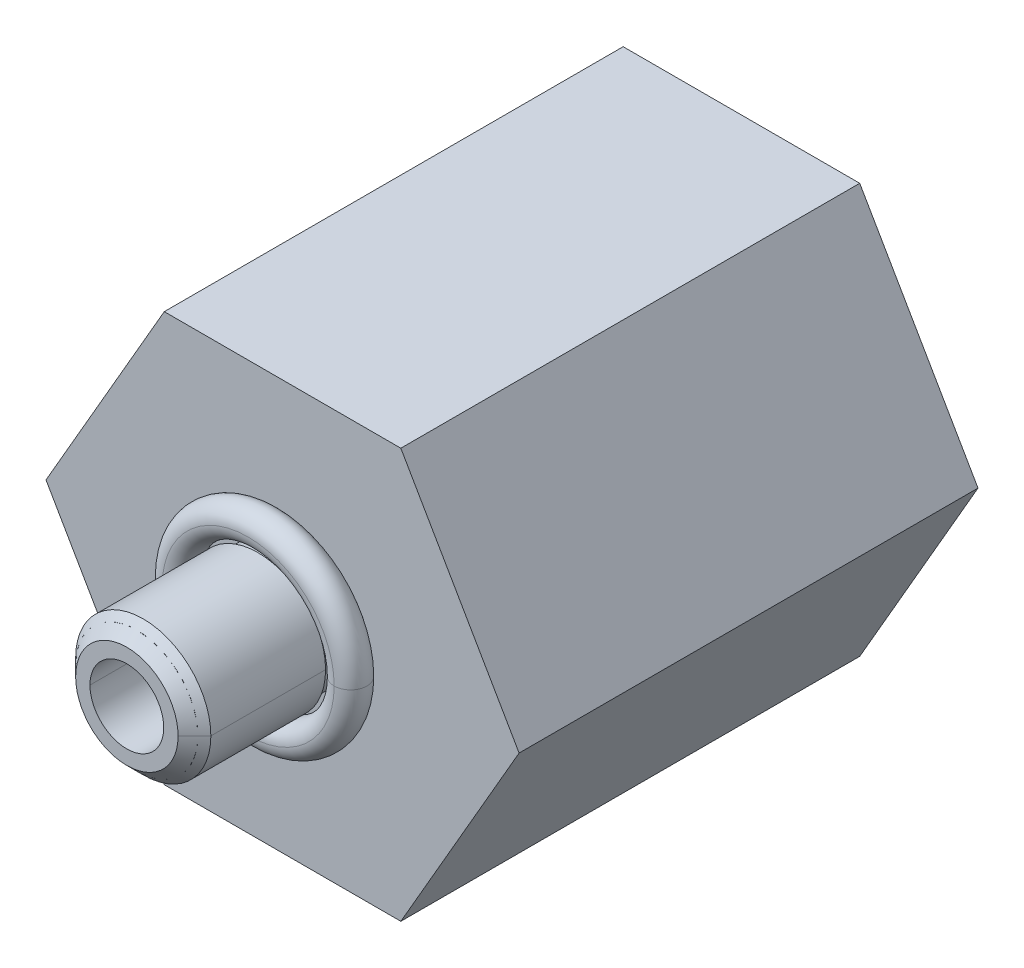
ISO-10303-21;
HEADER;
FILE_DESCRIPTION(('STEP AP214'),'2;1');
FILE_NAME('part.step','',(''),(''),'','','');
FILE_SCHEMA(('AUTOMOTIVE_DESIGN { 1 0 10303 214 1 1 1 1 }'));
ENDSEC;
DATA;
#1=APPLICATION_CONTEXT('core data for automotive mechanical design processes');
#2=APPLICATION_PROTOCOL_DEFINITION('international standard','automotive_design',2000,#1);
#3=PRODUCT_CONTEXT('',#1,'mechanical');
#4=PRODUCT('Part','Part','',(#3));
#5=PRODUCT_RELATED_PRODUCT_CATEGORY('part','',(#4));
#6=PRODUCT_DEFINITION_FORMATION('','',#4);
#7=PRODUCT_DEFINITION_CONTEXT('part definition',#1,'design');
#8=PRODUCT_DEFINITION('design','',#6,#7);
#9=PRODUCT_DEFINITION_SHAPE('','',#8);
#10=(LENGTH_UNIT() NAMED_UNIT(*) SI_UNIT(.MILLI.,.METRE.));
#11=(NAMED_UNIT(*) PLANE_ANGLE_UNIT() SI_UNIT($,.RADIAN.));
#12=(NAMED_UNIT(*) SI_UNIT($,.STERADIAN.) SOLID_ANGLE_UNIT());
#13=UNCERTAINTY_MEASURE_WITH_UNIT(LENGTH_MEASURE(1.E-05),#10,'distance_accuracy_value','');
#14=(GEOMETRIC_REPRESENTATION_CONTEXT(3) GLOBAL_UNCERTAINTY_ASSIGNED_CONTEXT((#13)) GLOBAL_UNIT_ASSIGNED_CONTEXT((#10,
#11,#12)) REPRESENTATION_CONTEXT('',''));
#15=CARTESIAN_POINT('',(0.,0.,0.));
#16=DIRECTION('',(0.,0.,1.));
#17=DIRECTION('',(1.,0.,0.));
#18=AXIS2_PLACEMENT_3D('',#15,#16,#17);
#19=CARTESIAN_POINT('',(0.,0.,3.937));
#20=DIRECTION('',(0.,0.,-1.));
#21=DIRECTION('',(1.,0.,0.));
#22=AXIS2_PLACEMENT_3D('',#19,#20,#21);
#23=CONICAL_SURFACE('',#22,5.3122622078521,0.0570722665402047);
#24=CARTESIAN_POINT('',(0.,0.,7.874));
#25=DIRECTION('',(0.,0.,-1.));
#26=DIRECTION('',(-1.,0.,0.));
#27=AXIS2_PLACEMENT_3D('',#24,#25,#26);
#28=CIRCLE('',#27,5.08732441570478);
#29=CARTESIAN_POINT('',(-5.08732441570478,0.,7.874));
#30=VERTEX_POINT('',#29);
#31=CARTESIAN_POINT('',(5.08732441570478,0.,7.874));
#32=VERTEX_POINT('',#31);
#33=EDGE_CURVE('P0_E26',#30,#32,#28,.T.);
#34=ORIENTED_EDGE('',*,*,#33,.T.);
#35=CARTESIAN_POINT('',(5.08732441570478,0.,7.874));
#36=DIRECTION('',(0.0570412885398825,0.,-0.998371820216151));
#37=VECTOR('',#36,1.);
#38=LINE('',#35,#37);
#39=CARTESIAN_POINT('',(5.53719999999961,0.,0.));
#40=VERTEX_POINT('',#39);
#41=EDGE_CURVE('P0_E10',#32,#40,#38,.T.);
#42=ORIENTED_EDGE('',*,*,#41,.T.);
#43=CARTESIAN_POINT('',(0.,0.,0.));
#44=DIRECTION('',(0.,0.,1.));
#45=DIRECTION('',(1.,0.,0.));
#46=AXIS2_PLACEMENT_3D('',#43,#44,#45);
#47=CIRCLE('',#46,5.53719999999942);
#48=CARTESIAN_POINT('',(-5.53719999999961,0.,0.));
#49=VERTEX_POINT('',#48);
#50=EDGE_CURVE('P0_E74',#40,#49,#47,.T.);
#51=ORIENTED_EDGE('',*,*,#50,.T.);
#52=CARTESIAN_POINT('',(-5.53719999999942,0.,0.));
#53=DIRECTION('',(0.0570412885398825,0.,0.998371820216151));
#54=VECTOR('',#53,1.);
#55=LINE('',#52,#54);
#56=EDGE_CURVE('P0_E119',#49,#30,#55,.T.);
#57=ORIENTED_EDGE('',*,*,#56,.T.);
#58=EDGE_LOOP('',(#34,#42,#51,#57));
#59=FACE_BOUND('',#58,.T.);
#60=ADVANCED_FACE('P0_F15',(#59),#23,.T.);
#61=CARTESIAN_POINT('',(0.,0.,3.937));
#62=DIRECTION('',(0.,0.,-1.));
#63=DIRECTION('',(1.,0.,0.));
#64=AXIS2_PLACEMENT_3D('',#61,#62,#63);
#65=CONICAL_SURFACE('',#64,5.3122622078521,0.0570722665402047);
#66=CARTESIAN_POINT('',(0.,0.,0.));
#67=DIRECTION('',(0.,0.,1.));
#68=DIRECTION('',(-1.,0.,0.));
#69=AXIS2_PLACEMENT_3D('',#66,#67,#68);
#70=CIRCLE('',#69,5.53719999999942);
#71=EDGE_CURVE('P0_E84',#49,#40,#70,.T.);
#72=ORIENTED_EDGE('',*,*,#71,.T.);
#73=ORIENTED_EDGE('',*,*,#41,.F.);
#74=CARTESIAN_POINT('',(0.,0.,7.874));
#75=DIRECTION('',(0.,0.,-1.));
#76=DIRECTION('',(1.,0.,0.));
#77=AXIS2_PLACEMENT_3D('',#74,#75,#76);
#78=CIRCLE('',#77,5.08732441570478);
#79=EDGE_CURVE('P0_E53',#32,#30,#78,.T.);
#80=ORIENTED_EDGE('',*,*,#79,.T.);
#81=ORIENTED_EDGE('',*,*,#56,.F.);
#82=EDGE_LOOP('',(#72,#73,#80,#81));
#83=FACE_BOUND('',#82,.T.);
#84=ADVANCED_FACE('P0_F89',(#83),#65,.T.);
#85=CARTESIAN_POINT('',(0.,0.,0.));
#86=DIRECTION('',(0.,0.,-1.));
#87=DIRECTION('',(0.,-1.,0.));
#88=AXIS2_PLACEMENT_3D('',#85,#86,#87);
#89=PLANE('',#88);
#90=CARTESIAN_POINT('',(-5.08,0.,0.));
#91=CARTESIAN_POINT('',(-5.08,-0.500058510185671,0.));
#92=CARTESIAN_POINT('',(-4.98238922444841,-0.991058835841932,0.));
#93=CARTESIAN_POINT('',(-4.88493882071838,-1.48125246145747,0.));
#94=CARTESIAN_POINT('',(-4.69330802515734,-1.94403183641466,0.));
#95=CARTESIAN_POINT('',(-4.50209807133947,-2.40579489831895,0.));
#96=CARTESIAN_POINT('',(-4.22386563049693,-2.82229678373958,0.));
#97=CARTESIAN_POINT('',(-3.94624421788446,-3.23788398642552,0.));
#98=CARTESIAN_POINT('',(-3.59210244842766,-3.59210244842766,0.));
#99=CARTESIAN_POINT('',(-3.23873841221395,-3.94554300876168,0.));
#100=CARTESIAN_POINT('',(-2.82229678373958,-4.22386563049693,0.));
#101=CARTESIAN_POINT('',(-2.40676970566655,-4.50157702595698,0.));
#102=CARTESIAN_POINT('',(-1.94403183641466,-4.69330802515734,0.));
#103=CARTESIAN_POINT('',(-1.48231018906274,-4.8846179625574,0.));
#104=CARTESIAN_POINT('',(-0.991058835841934,-4.98238922444841,0.));
#105=CARTESIAN_POINT('',(-0.500886323184134,-5.07994577018133,0.));
#106=CARTESIAN_POINT('',(0.,-5.08,0.));
#107=CARTESIAN_POINT('',(0.499786323195578,-5.08005411072419,0.));
#108=CARTESIAN_POINT('',(0.991058835841932,-4.98238922444841,0.));
#109=CARTESIAN_POINT('',(1.48125246145766,-4.88493882071834,0.));
#110=CARTESIAN_POINT('',(1.94403183641466,-4.69330802515734,0.));
#111=CARTESIAN_POINT('',(2.40579489832119,-4.5020980713385,0.));
#112=CARTESIAN_POINT('',(2.82229678373958,-4.22386563049693,0.));
#113=CARTESIAN_POINT('',(3.23788398642889,-3.94624421788168,0.));
#114=CARTESIAN_POINT('',(3.59210244842766,-3.59210244842766,0.));
#115=CARTESIAN_POINT('',(3.94554300876287,-3.23873841221217,0.));
#116=CARTESIAN_POINT('',(4.22386563049693,-2.82229678373958,0.));
#117=CARTESIAN_POINT('',(4.50157702595594,-2.40676970566811,0.));
#118=CARTESIAN_POINT('',(4.69330802515734,-1.94403183641466,0.));
#119=CARTESIAN_POINT('',(4.88461796255624,-1.48231018906649,0.));
#120=CARTESIAN_POINT('',(4.98238922444841,-0.991058835841934,0.));
#121=CARTESIAN_POINT('',(5.08,-0.5006138456576,0.));
#122=CARTESIAN_POINT('',(5.08,0.,0.));
#123=B_SPLINE_CURVE_WITH_KNOTS('',2,(#90,#91,#92,#93,#94,#95,#96,#97,#98,#99,#100,#101,#102,
#103,#104,#105,#106,#107,#108,#109,#110,#111,#112,#113,#114,#115,#116,#117,#118,#119,#120,#121,
#122),.UNSPECIFIED.,.F.,.F.,(3,2,2,2,2,2,2,2,2,2,2,2,2,2,2,2,3),(0.,0.0625,0.125,0.1875,0.25,
0.3125,0.375,0.4375,0.5,0.5625,0.625,0.6875,0.75,0.8125,0.875,0.9375,1.),.UNSPECIFIED.);
#124=CARTESIAN_POINT('',(-5.08,0.,0.));
#125=VERTEX_POINT('',#124);
#126=CARTESIAN_POINT('',(5.08,0.,0.));
#127=VERTEX_POINT('',#126);
#128=EDGE_CURVE('P0_E45',#125,#127,#123,.T.);
#129=ORIENTED_EDGE('',*,*,#128,.T.);
#130=CARTESIAN_POINT('',(5.08,0.,0.));
#131=CARTESIAN_POINT('',(5.08,0.500058510185671,0.));
#132=CARTESIAN_POINT('',(4.98238922444841,0.991058835841932,0.));
#133=CARTESIAN_POINT('',(4.88493882071838,1.48125246145747,0.));
#134=CARTESIAN_POINT('',(4.69330802515734,1.94403183641466,0.));
#135=CARTESIAN_POINT('',(4.50209807133947,2.40579489831895,0.));
#136=CARTESIAN_POINT('',(4.22386563049693,2.82229678373958,0.));
#137=CARTESIAN_POINT('',(3.94624421788446,3.23788398642552,0.));
#138=CARTESIAN_POINT('',(3.59210244842766,3.59210244842766,0.));
#139=CARTESIAN_POINT('',(3.23873841221395,3.94554300876168,0.));
#140=CARTESIAN_POINT('',(2.82229678373958,4.22386563049693,0.));
#141=CARTESIAN_POINT('',(2.40676970566655,4.50157702595698,0.));
#142=CARTESIAN_POINT('',(1.94403183641466,4.69330802515734,0.));
#143=CARTESIAN_POINT('',(1.48231018906274,4.8846179625574,0.));
#144=CARTESIAN_POINT('',(0.991058835841934,4.98238922444841,0.));
#145=CARTESIAN_POINT('',(0.500886323184134,5.07994577018133,0.));
#146=CARTESIAN_POINT('',(0.,5.08,0.));
#147=CARTESIAN_POINT('',(-0.499786323195578,5.08005411072419,0.));
#148=CARTESIAN_POINT('',(-0.991058835841932,4.98238922444841,0.));
#149=CARTESIAN_POINT('',(-1.48125246145766,4.88493882071834,0.));
#150=CARTESIAN_POINT('',(-1.94403183641466,4.69330802515734,0.));
#151=CARTESIAN_POINT('',(-2.40579489832119,4.5020980713385,0.));
#152=CARTESIAN_POINT('',(-2.82229678373958,4.22386563049693,0.));
#153=CARTESIAN_POINT('',(-3.23788398642889,3.94624421788168,0.));
#154=CARTESIAN_POINT('',(-3.59210244842766,3.59210244842766,0.));
#155=CARTESIAN_POINT('',(-3.94554300876287,3.23873841221217,0.));
#156=CARTESIAN_POINT('',(-4.22386563049693,2.82229678373958,0.));
#157=CARTESIAN_POINT('',(-4.50157702595594,2.40676970566811,0.));
#158=CARTESIAN_POINT('',(-4.69330802515734,1.94403183641466,0.));
#159=CARTESIAN_POINT('',(-4.88461796255624,1.48231018906649,0.));
#160=CARTESIAN_POINT('',(-4.98238922444841,0.991058835841934,0.));
#161=CARTESIAN_POINT('',(-5.08,0.5006138456576,0.));
#162=CARTESIAN_POINT('',(-5.08,0.,0.));
#163=B_SPLINE_CURVE_WITH_KNOTS('',2,(#130,#131,#132,#133,#134,#135,#136,#137,#138,#139,#140,
#141,#142,#143,#144,#145,#146,#147,#148,#149,#150,#151,#152,#153,#154,#155,#156,#157,#158,#159,
#160,#161,#162),.UNSPECIFIED.,.F.,.F.,(3,2,2,2,2,2,2,2,2,2,2,2,2,2,2,2,3),(0.,0.0625,0.125,
0.1875,0.25,0.3125,0.375,0.4375,0.5,0.5625,0.625,0.6875,0.75,0.8125,0.875,0.9375,1.),.UNSPECIFIED.);
#164=EDGE_CURVE('P0_E50',#127,#125,#163,.T.);
#165=ORIENTED_EDGE('',*,*,#164,.T.);
#166=EDGE_LOOP('',(#129,#165));
#167=FACE_BOUND('',#166,.T.);
#168=ORIENTED_EDGE('',*,*,#71,.F.);
#169=ORIENTED_EDGE('',*,*,#50,.F.);
#170=EDGE_LOOP('',(#168,#169));
#171=FACE_BOUND('',#170,.T.);
#172=ADVANCED_FACE('P0_F16',(#167,#171),#89,.T.);
#173=OPEN_SHELL('',(#60,#84,#172));
#174=SHELL_BASED_SURFACE_MODEL('P0_B1',(#173));
#175=CARTESIAN_POINT('',(0.,0.,20.9550000003074));
#176=DIRECTION('',(0.,0.,-1.));
#177=DIRECTION('',(-1.,0.,0.));
#178=AXIS2_PLACEMENT_3D('',#175,#176,#177);
#179=CYLINDRICAL_SURFACE('',#178,1.8923);
#180=CARTESIAN_POINT('',(1.8923,0.,14.224));
#181=DIRECTION('',(0.,0.,1.));
#182=VECTOR('',#181,1.);
#183=LINE('',#180,#182);
#184=CARTESIAN_POINT('',(1.8923,0.,14.224));
#185=VERTEX_POINT('',#184);
#186=CARTESIAN_POINT('',(1.8923,0.,18.7452));
#187=VERTEX_POINT('',#186);
#188=EDGE_CURVE('P1_E27',#185,#187,#183,.T.);
#189=ORIENTED_EDGE('',*,*,#188,.T.);
#190=CARTESIAN_POINT('',(0.,0.,18.7452));
#191=DIRECTION('',(0.,0.,-1.));
#192=DIRECTION('',(1.,0.,0.));
#193=AXIS2_PLACEMENT_3D('',#190,#191,#192);
#194=CIRCLE('',#193,1.8923);
#195=CARTESIAN_POINT('',(-1.8923,0.,18.7452));
#196=VERTEX_POINT('',#195);
#197=EDGE_CURVE('P1_E11',#187,#196,#194,.T.);
#198=ORIENTED_EDGE('',*,*,#197,.T.);
#199=CARTESIAN_POINT('',(-1.8923,0.,18.7452));
#200=DIRECTION('',(0.,0.,-1.));
#201=VECTOR('',#200,1.);
#202=LINE('',#199,#201);
#203=CARTESIAN_POINT('',(-1.8923,0.,14.224));
#204=VERTEX_POINT('',#203);
#205=EDGE_CURVE('P1_E44',#196,#204,#202,.T.);
#206=ORIENTED_EDGE('',*,*,#205,.T.);
#207=CARTESIAN_POINT('',(0.,0.,14.224));
#208=DIRECTION('',(0.,0.,1.));
#209=DIRECTION('',(-1.,0.,0.));
#210=AXIS2_PLACEMENT_3D('',#207,#208,#209);
#211=CIRCLE('',#210,1.8923);
#212=EDGE_CURVE('P1_E51',#204,#185,#211,.T.);
#213=ORIENTED_EDGE('',*,*,#212,.T.);
#214=EDGE_LOOP('',(#189,#198,#206,#213));
#215=FACE_BOUND('',#214,.T.);
#216=ADVANCED_FACE('P1_F16',(#215),#179,.T.);
#217=CARTESIAN_POINT('',(0.,0.,20.9550000003074));
#218=DIRECTION('',(0.,0.,-1.));
#219=DIRECTION('',(-1.,0.,0.));
#220=AXIS2_PLACEMENT_3D('',#217,#218,#219);
#221=CYLINDRICAL_SURFACE('',#220,1.8923);
#222=ORIENTED_EDGE('',*,*,#205,.F.);
#223=CARTESIAN_POINT('',(0.,0.,18.7452));
#224=DIRECTION('',(0.,0.,-1.));
#225=DIRECTION('',(-1.,0.,0.));
#226=AXIS2_PLACEMENT_3D('',#223,#224,#225);
#227=CIRCLE('',#226,1.8923);
#228=EDGE_CURVE('P1_E35',#196,#187,#227,.T.);
#229=ORIENTED_EDGE('',*,*,#228,.T.);
#230=ORIENTED_EDGE('',*,*,#188,.F.);
#231=CARTESIAN_POINT('',(0.,0.,14.224));
#232=DIRECTION('',(0.,0.,1.));
#233=DIRECTION('',(1.,0.,0.));
#234=AXIS2_PLACEMENT_3D('',#231,#232,#233);
#235=CIRCLE('',#234,1.8923);
#236=EDGE_CURVE('P1_E41',#185,#204,#235,.T.);
#237=ORIENTED_EDGE('',*,*,#236,.T.);
#238=EDGE_LOOP('',(#222,#229,#230,#237));
#239=FACE_BOUND('',#238,.T.);
#240=ADVANCED_FACE('P1_F17',(#239),#221,.T.);
#241=OPEN_SHELL('',(#216,#240));
#242=SHELL_BASED_SURFACE_MODEL('P1_B1',(#241));
#243=CARTESIAN_POINT('',(0.,0.,3.937));
#244=DIRECTION('',(0.,0.,-1.));
#245=DIRECTION('',(1.,0.,0.));
#246=AXIS2_PLACEMENT_3D('',#243,#244,#245);
#247=CONICAL_SURFACE('',#246,4.8550622078521,0.0570722665402047);
#248=DIRECTION('',(-0.0570412885398872,0.,-0.99837182021615));
#249=VECTOR('',#248,1.);
#250=CARTESIAN_POINT('',(-4.6301244157042,0.,7.874));
#251=LINE('',#250,#249);
#252=CARTESIAN_POINT('',(-4.6301244157042,0.,7.874));
#253=VERTEX_POINT('',#252);
#254=CARTESIAN_POINT('',(-5.08,0.,0.));
#255=VERTEX_POINT('',#254);
#256=EDGE_CURVE('P2_E172',#253,#255,#251,.T.);
#257=ORIENTED_EDGE('',*,*,#256,.F.);
#258=CARTESIAN_POINT('',(0.,0.,7.874));
#259=DIRECTION('',(0.,0.,-1.));
#260=DIRECTION('',(1.,0.,0.));
#261=AXIS2_PLACEMENT_3D('',#258,#259,#260);
#262=CIRCLE('',#261,4.6301244157042);
#263=CARTESIAN_POINT('',(4.6301244157042,0.,7.874));
#264=VERTEX_POINT('',#263);
#265=EDGE_CURVE('P2_E196',#264,#253,#262,.T.);
#266=ORIENTED_EDGE('',*,*,#265,.F.);
#267=DIRECTION('',(0.0570412885398872,0.,-0.99837182021615));
#268=VECTOR('',#267,1.);
#269=CARTESIAN_POINT('',(4.6301244157042,0.,7.874));
#270=LINE('',#269,#268);
#271=CARTESIAN_POINT('',(5.08,0.,0.));
#272=VERTEX_POINT('',#271);
#273=EDGE_CURVE('P2_E176',#264,#272,#270,.T.);
#274=ORIENTED_EDGE('',*,*,#273,.T.);
#275=CARTESIAN_POINT('',(0.,0.,0.));
#276=DIRECTION('',(0.,0.,-1.));
#277=DIRECTION('',(1.,0.,0.));
#278=AXIS2_PLACEMENT_3D('',#275,#276,#277);
#279=CIRCLE('',#278,5.08);
#280=EDGE_CURVE('P2_E156',#272,#255,#279,.T.);
#281=ORIENTED_EDGE('',*,*,#280,.T.);
#282=EDGE_LOOP('',(#257,#266,#274,#281));
#283=FACE_BOUND('',#282,.T.);
#284=ADVANCED_FACE('P2_F16',(#283),#247,.F.);
#285=CARTESIAN_POINT('',(0.,0.,19.2913));
#286=DIRECTION('',(0.,0.,-1.));
#287=DIRECTION('',(1.,0.,0.));
#288=AXIS2_PLACEMENT_3D('',#285,#286,#287);
#289=CYLINDRICAL_SURFACE('',#288,2.0955);
#290=DIRECTION('',(4.11807492851E-11,4.278615811767E-11,1.));
#291=VECTOR('',#290,1.);
#292=CARTESIAN_POINT('',(-2.0955,0.,14.986));
#293=LINE('',#292,#291);
#294=CARTESIAN_POINT('',(-2.0955,0.,14.986));
#295=VERTEX_POINT('',#294);
#296=CARTESIAN_POINT('',(-2.0955,0.,18.542));
#297=VERTEX_POINT('',#296);
#298=EDGE_CURVE('P2_E107',#295,#297,#293,.T.);
#299=ORIENTED_EDGE('',*,*,#298,.F.);
#300=CARTESIAN_POINT('',(0.,0.,14.986));
#301=DIRECTION('',(0.,0.,1.));
#302=DIRECTION('',(-1.,0.,0.));
#303=AXIS2_PLACEMENT_3D('',#300,#301,#302);
#304=CIRCLE('',#303,2.0955);
#305=CARTESIAN_POINT('',(2.0955,0.,14.986));
#306=VERTEX_POINT('',#305);
#307=EDGE_CURVE('P2_E128',#295,#306,#304,.T.);
#308=ORIENTED_EDGE('',*,*,#307,.T.);
#309=DIRECTION('',(-4.11807492851E-11,-4.278594717584E-11,1.));
#310=VECTOR('',#309,1.);
#311=CARTESIAN_POINT('',(2.0955,0.,14.986));
#312=LINE('',#311,#310);
#313=CARTESIAN_POINT('',(2.0955,0.,18.542));
#314=VERTEX_POINT('',#313);
#315=EDGE_CURVE('P2_E163',#306,#314,#312,.T.);
#316=ORIENTED_EDGE('',*,*,#315,.T.);
#317=CARTESIAN_POINT('',(0.,0.,18.542));
#318=DIRECTION('',(0.,0.,1.));
#319=DIRECTION('',(-1.,0.,0.));
#320=AXIS2_PLACEMENT_3D('',#317,#318,#319);
#321=CIRCLE('',#320,2.0955);
#322=EDGE_CURVE('P2_E11',#297,#314,#321,.T.);
#323=ORIENTED_EDGE('',*,*,#322,.F.);
#324=EDGE_LOOP('',(#299,#308,#316,#323));
#325=FACE_BOUND('',#324,.T.);
#326=ADVANCED_FACE('P2_F385',(#325),#289,.T.);
#327=CARTESIAN_POINT('',(0.,0.,18.7960000001397));
#328=DIRECTION('',(0.,0.,-1.));
#329=DIRECTION('',(0.,-1.,0.));
#330=AXIS2_PLACEMENT_3D('',#327,#328,#329);
#331=CONICAL_SURFACE('',#330,1.84149999986081,0.7853981633973);
#332=DIRECTION('',(-0.707106781186597,-2.13927451902699E-12,-0.707106781186498));
#333=VECTOR('',#332,1.);
#334=CARTESIAN_POINT('',(-1.58749999985217,1.53684648003394E-10,19.0500000001473));
#335=LINE('',#334,#333);
#336=CARTESIAN_POINT('',(-1.5875,0.,19.05));
#337=VERTEX_POINT('',#336);
#338=EDGE_CURVE('P2_E27',#337,#297,#335,.T.);
#339=ORIENTED_EDGE('',*,*,#338,.T.);
#340=ORIENTED_EDGE('',*,*,#322,.T.);
#341=DIRECTION('',(0.707106781186597,2.13844621588599E-12,-0.707106781186498));
#342=VECTOR('',#341,1.);
#343=CARTESIAN_POINT('',(1.58749999985217,-1.53683302824296E-10,19.0500000001473));
#344=LINE('',#343,#342);
#345=CARTESIAN_POINT('',(1.5875,0.,19.05));
#346=VERTEX_POINT('',#345);
#347=EDGE_CURVE('P2_E216',#346,#314,#344,.T.);
#348=ORIENTED_EDGE('',*,*,#347,.F.);
#349=CARTESIAN_POINT('',(0.,0.,19.05));
#350=DIRECTION('',(0.,0.,1.));
#351=DIRECTION('',(-1.,0.,0.));
#352=AXIS2_PLACEMENT_3D('',#349,#350,#351);
#353=CIRCLE('',#352,1.5875);
#354=EDGE_CURVE('P2_E344',#337,#346,#353,.T.);
#355=ORIENTED_EDGE('',*,*,#354,.F.);
#356=EDGE_LOOP('',(#339,#340,#348,#355));
#357=FACE_BOUND('',#356,.T.);
#358=ADVANCED_FACE('P2_F390',(#357),#331,.T.);
#359=CARTESIAN_POINT('',(0.,0.,18.7960000001397));
#360=DIRECTION('',(0.,0.,-1.));
#361=DIRECTION('',(0.,-1.,0.));
#362=AXIS2_PLACEMENT_3D('',#359,#360,#361);
#363=CONICAL_SURFACE('',#362,1.84149999986081,0.7853981633973);
#364=ORIENTED_EDGE('',*,*,#347,.T.);
#365=CARTESIAN_POINT('',(0.,0.,18.542));
#366=DIRECTION('',(0.,0.,1.));
#367=DIRECTION('',(1.,0.,0.));
#368=AXIS2_PLACEMENT_3D('',#365,#366,#367);
#369=CIRCLE('',#368,2.0955);
#370=EDGE_CURVE('P2_E333',#314,#297,#369,.T.);
#371=ORIENTED_EDGE('',*,*,#370,.T.);
#372=ORIENTED_EDGE('',*,*,#338,.F.);
#373=CARTESIAN_POINT('',(0.,0.,19.05));
#374=DIRECTION('',(0.,0.,1.));
#375=DIRECTION('',(1.,0.,0.));
#376=AXIS2_PLACEMENT_3D('',#373,#374,#375);
#377=CIRCLE('',#376,1.5875);
#378=EDGE_CURVE('P2_E20',#346,#337,#377,.T.);
#379=ORIENTED_EDGE('',*,*,#378,.F.);
#380=EDGE_LOOP('',(#364,#371,#372,#379));
#381=FACE_BOUND('',#380,.T.);
#382=ADVANCED_FACE('P2_F408',(#381),#363,.T.);
#383=CARTESIAN_POINT('',(0.,0.,19.2913));
#384=DIRECTION('',(0.,0.,-1.));
#385=DIRECTION('',(1.,0.,0.));
#386=AXIS2_PLACEMENT_3D('',#383,#384,#385);
#387=CYLINDRICAL_SURFACE('',#386,2.0955);
#388=ORIENTED_EDGE('',*,*,#315,.F.);
#389=CARTESIAN_POINT('',(0.,0.,14.986));
#390=DIRECTION('',(0.,0.,-1.));
#391=DIRECTION('',(-1.,0.,0.));
#392=AXIS2_PLACEMENT_3D('',#389,#390,#391);
#393=CIRCLE('',#392,2.0955);
#394=EDGE_CURVE('P2_E166',#295,#306,#393,.T.);
#395=ORIENTED_EDGE('',*,*,#394,.F.);
#396=ORIENTED_EDGE('',*,*,#298,.T.);
#397=ORIENTED_EDGE('',*,*,#370,.F.);
#398=EDGE_LOOP('',(#388,#395,#396,#397));
#399=FACE_BOUND('',#398,.T.);
#400=ADVANCED_FACE('P2_F405',(#399),#387,.T.);
#401=CARTESIAN_POINT('',(0.,0.,14.986));
#402=DIRECTION('',(0.,0.,-1.));
#403=DIRECTION('',(0.,-1.,0.));
#404=AXIS2_PLACEMENT_3D('',#401,#402,#403);
#405=PLANE('',#404);
#406=CARTESIAN_POINT('',(0.,0.,14.986));
#407=DIRECTION('',(0.,0.,-1.));
#408=DIRECTION('',(-1.,0.,0.));
#409=AXIS2_PLACEMENT_3D('',#406,#407,#408);
#410=CIRCLE('',#409,1.8415);
#411=CARTESIAN_POINT('',(-1.8415,0.,14.986));
#412=VERTEX_POINT('',#411);
#413=CARTESIAN_POINT('',(1.8415,0.,14.986));
#414=VERTEX_POINT('',#413);
#415=EDGE_CURVE('P2_E130',#412,#414,#410,.T.);
#416=ORIENTED_EDGE('',*,*,#415,.F.);
#417=CARTESIAN_POINT('',(0.,0.,14.986));
#418=DIRECTION('',(0.,0.,1.));
#419=DIRECTION('',(-1.,0.,0.));
#420=AXIS2_PLACEMENT_3D('',#417,#418,#419);
#421=CIRCLE('',#420,1.8415);
#422=EDGE_CURVE('P2_E115',#412,#414,#421,.T.);
#423=ORIENTED_EDGE('',*,*,#422,.T.);
#424=EDGE_LOOP('',(#416,#423));
#425=FACE_BOUND('',#424,.T.);
#426=ORIENTED_EDGE('',*,*,#307,.F.);
#427=ORIENTED_EDGE('',*,*,#394,.T.);
#428=EDGE_LOOP('',(#426,#427));
#429=FACE_BOUND('',#428,.T.);
#430=ADVANCED_FACE('P2_F131',(#425,#429),#405,.T.);
#431=CARTESIAN_POINT('',(0.,0.,19.2913));
#432=DIRECTION('',(0.,0.,-1.));
#433=DIRECTION('',(1.,0.,0.));
#434=AXIS2_PLACEMENT_3D('',#431,#432,#433);
#435=CYLINDRICAL_SURFACE('',#434,1.8415);
#436=DIRECTION('',(0.,0.,1.));
#437=VECTOR('',#436,1.);
#438=CARTESIAN_POINT('',(1.8415,0.,14.224));
#439=LINE('',#438,#437);
#440=CARTESIAN_POINT('',(1.8415,0.,14.224));
#441=VERTEX_POINT('',#440);
#442=EDGE_CURVE('P2_E125',#441,#414,#439,.T.);
#443=ORIENTED_EDGE('',*,*,#442,.T.);
#444=ORIENTED_EDGE('',*,*,#422,.F.);
#445=DIRECTION('',(0.,0.,1.));
#446=VECTOR('',#445,1.);
#447=CARTESIAN_POINT('',(-1.8415,0.,14.224));
#448=LINE('',#447,#446);
#449=CARTESIAN_POINT('',(-1.8415,0.,14.224));
#450=VERTEX_POINT('',#449);
#451=EDGE_CURVE('P2_E123',#450,#412,#448,.T.);
#452=ORIENTED_EDGE('',*,*,#451,.F.);
#453=CARTESIAN_POINT('',(0.,0.,14.224));
#454=DIRECTION('',(0.,0.,-1.));
#455=DIRECTION('',(1.,0.,0.));
#456=AXIS2_PLACEMENT_3D('',#453,#454,#455);
#457=CIRCLE('',#456,1.8415);
#458=EDGE_CURVE('P2_E148',#441,#450,#457,.T.);
#459=ORIENTED_EDGE('',*,*,#458,.F.);
#460=EDGE_LOOP('',(#443,#444,#452,#459));
#461=FACE_BOUND('',#460,.T.);
#462=ADVANCED_FACE('P2_F120',(#461),#435,.T.);
#463=CARTESIAN_POINT('',(0.,0.,19.2913));
#464=DIRECTION('',(0.,0.,-1.));
#465=DIRECTION('',(1.,0.,0.));
#466=AXIS2_PLACEMENT_3D('',#463,#464,#465);
#467=CYLINDRICAL_SURFACE('',#466,1.8415);
#468=ORIENTED_EDGE('',*,*,#451,.T.);
#469=ORIENTED_EDGE('',*,*,#415,.T.);
#470=ORIENTED_EDGE('',*,*,#442,.F.);
#471=CARTESIAN_POINT('',(0.,0.,14.224));
#472=DIRECTION('',(0.,0.,-1.));
#473=DIRECTION('',(-1.,0.,0.));
#474=AXIS2_PLACEMENT_3D('',#471,#472,#473);
#475=CIRCLE('',#474,1.8415);
#476=EDGE_CURVE('P2_E138',#450,#441,#475,.T.);
#477=ORIENTED_EDGE('',*,*,#476,.F.);
#478=EDGE_LOOP('',(#468,#469,#470,#477));
#479=FACE_BOUND('',#478,.T.);
#480=ADVANCED_FACE('P2_F136',(#479),#467,.T.);
#481=CARTESIAN_POINT('',(0.,0.,14.224));
#482=DIRECTION('',(0.,0.,1.));
#483=DIRECTION('',(1.,0.,0.));
#484=AXIS2_PLACEMENT_3D('',#481,#482,#483);
#485=PLANE('',#484);
#486=ORIENTED_EDGE('',*,*,#458,.T.);
#487=ORIENTED_EDGE('',*,*,#476,.T.);
#488=EDGE_LOOP('',(#486,#487));
#489=FACE_BOUND('',#488,.T.);
#490=DIRECTION('',(0.500000000000017,-0.866025403784429,0.));
#491=VECTOR('',#490,1.);
#492=CARTESIAN_POINT('',(-7.33234841870792,0.,14.224));
#493=LINE('',#492,#491);
#494=CARTESIAN_POINT('',(-7.33234841870792,0.,14.224));
#495=VERTEX_POINT('',#494);
#496=CARTESIAN_POINT('',(-3.66617420935396,-6.35,14.224));
#497=VERTEX_POINT('',#496);
#498=EDGE_CURVE('P2_E209',#495,#497,#493,.T.);
#499=ORIENTED_EDGE('',*,*,#498,.T.);
#500=DIRECTION('',(1.,0.,0.));
#501=VECTOR('',#500,1.);
#502=CARTESIAN_POINT('',(-3.66617420935396,-6.35,14.224));
#503=LINE('',#502,#501);
#504=CARTESIAN_POINT('',(3.66617420935396,-6.35,14.224));
#505=VERTEX_POINT('',#504);
#506=EDGE_CURVE('P2_E293',#497,#505,#503,.T.);
#507=ORIENTED_EDGE('',*,*,#506,.T.);
#508=DIRECTION('',(0.500000000000017,0.866025403784429,0.));
#509=VECTOR('',#508,1.);
#510=CARTESIAN_POINT('',(3.66617420935396,-6.35,14.224));
#511=LINE('',#510,#509);
#512=CARTESIAN_POINT('',(7.33234841870792,0.,14.224));
#513=VERTEX_POINT('',#512);
#514=EDGE_CURVE('P2_E297',#505,#513,#511,.T.);
#515=ORIENTED_EDGE('',*,*,#514,.T.);
#516=DIRECTION('',(-0.500000000000017,0.866025403784429,0.));
#517=VECTOR('',#516,1.);
#518=CARTESIAN_POINT('',(7.33234841870792,0.,14.224));
#519=LINE('',#518,#517);
#520=CARTESIAN_POINT('',(3.66617420935396,6.35,14.224));
#521=VERTEX_POINT('',#520);
#522=EDGE_CURVE('P2_E317',#513,#521,#519,.T.);
#523=ORIENTED_EDGE('',*,*,#522,.T.);
#524=DIRECTION('',(-1.,0.,0.));
#525=VECTOR('',#524,1.);
#526=CARTESIAN_POINT('',(3.66617420935396,6.35,14.224));
#527=LINE('',#526,#525);
#528=CARTESIAN_POINT('',(-3.66617420935396,6.35,14.224));
#529=VERTEX_POINT('',#528);
#530=EDGE_CURVE('P2_E200',#521,#529,#527,.T.);
#531=ORIENTED_EDGE('',*,*,#530,.T.);
#532=DIRECTION('',(-0.500000000000017,-0.866025403784429,0.));
#533=VECTOR('',#532,1.);
#534=CARTESIAN_POINT('',(-3.66617420935396,6.35,14.224));
#535=LINE('',#534,#533);
#536=EDGE_CURVE('P2_E162',#529,#495,#535,.T.);
#537=ORIENTED_EDGE('',*,*,#536,.T.);
#538=EDGE_LOOP('',(#499,#507,#515,#523,#531,#537));
#539=FACE_BOUND('',#538,.T.);
#540=ADVANCED_FACE('P2_F295',(#489,#539),#485,.T.);
#541=CARTESIAN_POINT('',(-7.33234841870792,0.,0.));
#542=DIRECTION('',(-0.866025403784429,-0.500000000000017,0.));
#543=DIRECTION('',(-0.500000000000017,0.866025403784429,0.));
#544=AXIS2_PLACEMENT_3D('',#541,#542,#543);
#545=PLANE('',#544);
#546=DIRECTION('',(0.,0.,1.));
#547=VECTOR('',#546,1.);
#548=CARTESIAN_POINT('',(-3.66617420935396,-6.35,0.));
#549=LINE('',#548,#547);
#550=CARTESIAN_POINT('',(-3.66617420935396,-6.35,0.));
#551=VERTEX_POINT('',#550);
#552=EDGE_CURVE('P2_E212',#551,#497,#549,.T.);
#553=ORIENTED_EDGE('',*,*,#552,.T.);
#554=ORIENTED_EDGE('',*,*,#498,.F.);
#555=DIRECTION('',(0.,0.,1.));
#556=VECTOR('',#555,1.);
#557=CARTESIAN_POINT('',(-7.33234841870792,0.,0.));
#558=LINE('',#557,#556);
#559=CARTESIAN_POINT('',(-7.33234841870792,0.,0.));
#560=VERTEX_POINT('',#559);
#561=EDGE_CURVE('P2_E158',#560,#495,#558,.T.);
#562=ORIENTED_EDGE('',*,*,#561,.F.);
#563=DIRECTION('',(0.500000000000017,-0.866025403784429,0.));
#564=VECTOR('',#563,1.);
#565=CARTESIAN_POINT('',(-7.33234841870792,0.,0.));
#566=LINE('',#565,#564);
#567=EDGE_CURVE('P2_E157',#560,#551,#566,.T.);
#568=ORIENTED_EDGE('',*,*,#567,.T.);
#569=EDGE_LOOP('',(#553,#554,#562,#568));
#570=FACE_BOUND('',#569,.T.);
#571=ADVANCED_FACE('P2_F368',(#570),#545,.T.);
#572=CARTESIAN_POINT('',(-3.66617420935396,-6.35,0.));
#573=DIRECTION('',(0.,-1.,0.));
#574=DIRECTION('',(0.,0.,-1.));
#575=AXIS2_PLACEMENT_3D('',#572,#573,#574);
#576=PLANE('',#575);
#577=DIRECTION('',(0.,0.,1.));
#578=VECTOR('',#577,1.);
#579=CARTESIAN_POINT('',(3.66617420935396,-6.35,0.));
#580=LINE('',#579,#578);
#581=CARTESIAN_POINT('',(3.66617420935396,-6.35,0.));
#582=VERTEX_POINT('',#581);
#583=EDGE_CURVE('P2_E199',#582,#505,#580,.T.);
#584=ORIENTED_EDGE('',*,*,#583,.T.);
#585=ORIENTED_EDGE('',*,*,#506,.F.);
#586=ORIENTED_EDGE('',*,*,#552,.F.);
#587=DIRECTION('',(1.,0.,0.));
#588=VECTOR('',#587,1.);
#589=CARTESIAN_POINT('',(-3.66617420935396,-6.35,0.));
#590=LINE('',#589,#588);
#591=EDGE_CURVE('P2_E230',#551,#582,#590,.T.);
#592=ORIENTED_EDGE('',*,*,#591,.T.);
#593=EDGE_LOOP('',(#584,#585,#586,#592));
#594=FACE_BOUND('',#593,.T.);
#595=ADVANCED_FACE('P2_F305',(#594),#576,.T.);
#596=CARTESIAN_POINT('',(3.66617420935396,-6.35,0.));
#597=DIRECTION('',(0.866025403784429,-0.500000000000017,0.));
#598=DIRECTION('',(0.,0.,-1.));
#599=AXIS2_PLACEMENT_3D('',#596,#597,#598);
#600=PLANE('',#599);
#601=DIRECTION('',(0.,0.,1.));
#602=VECTOR('',#601,1.);
#603=CARTESIAN_POINT('',(7.33234841870792,0.,0.));
#604=LINE('',#603,#602);
#605=CARTESIAN_POINT('',(7.33234841870792,0.,0.));
#606=VERTEX_POINT('',#605);
#607=EDGE_CURVE('P2_E309',#606,#513,#604,.T.);
#608=ORIENTED_EDGE('',*,*,#607,.T.);
#609=ORIENTED_EDGE('',*,*,#514,.F.);
#610=ORIENTED_EDGE('',*,*,#583,.F.);
#611=DIRECTION('',(0.500000000000017,0.866025403784429,0.));
#612=VECTOR('',#611,1.);
#613=CARTESIAN_POINT('',(3.66617420935396,-6.35,0.));
#614=LINE('',#613,#612);
#615=EDGE_CURVE('P2_E221',#582,#606,#614,.T.);
#616=ORIENTED_EDGE('',*,*,#615,.T.);
#617=EDGE_LOOP('',(#608,#609,#610,#616));
#618=FACE_BOUND('',#617,.T.);
#619=ADVANCED_FACE('P2_F308',(#618),#600,.T.);
#620=CARTESIAN_POINT('',(7.33234841870792,0.,0.));
#621=DIRECTION('',(0.866025403784429,0.500000000000017,0.));
#622=DIRECTION('',(0.,0.,-1.));
#623=AXIS2_PLACEMENT_3D('',#620,#621,#622);
#624=PLANE('',#623);
#625=DIRECTION('',(0.,0.,1.));
#626=VECTOR('',#625,1.);
#627=CARTESIAN_POINT('',(3.66617420935396,6.35,0.));
#628=LINE('',#627,#626);
#629=CARTESIAN_POINT('',(3.66617420935396,6.35,0.));
#630=VERTEX_POINT('',#629);
#631=EDGE_CURVE('P2_E203',#630,#521,#628,.T.);
#632=ORIENTED_EDGE('',*,*,#631,.T.);
#633=ORIENTED_EDGE('',*,*,#522,.F.);
#634=ORIENTED_EDGE('',*,*,#607,.F.);
#635=DIRECTION('',(-0.500000000000017,0.866025403784429,0.));
#636=VECTOR('',#635,1.);
#637=CARTESIAN_POINT('',(7.33234841870792,0.,0.));
#638=LINE('',#637,#636);
#639=EDGE_CURVE('P2_E217',#606,#630,#638,.T.);
#640=ORIENTED_EDGE('',*,*,#639,.T.);
#641=EDGE_LOOP('',(#632,#633,#634,#640));
#642=FACE_BOUND('',#641,.T.);
#643=ADVANCED_FACE('P2_F372',(#642),#624,.T.);
#644=CARTESIAN_POINT('',(3.66617420935396,6.35,0.));
#645=DIRECTION('',(0.,1.,0.));
#646=DIRECTION('',(1.,0.,0.));
#647=AXIS2_PLACEMENT_3D('',#644,#645,#646);
#648=PLANE('',#647);
#649=DIRECTION('',(0.,0.,1.));
#650=VECTOR('',#649,1.);
#651=CARTESIAN_POINT('',(-3.66617420935396,6.35,0.));
#652=LINE('',#651,#650);
#653=CARTESIAN_POINT('',(-3.66617420935396,6.35,0.));
#654=VERTEX_POINT('',#653);
#655=EDGE_CURVE('P2_E204',#654,#529,#652,.T.);
#656=ORIENTED_EDGE('',*,*,#655,.T.);
#657=ORIENTED_EDGE('',*,*,#530,.F.);
#658=ORIENTED_EDGE('',*,*,#631,.F.);
#659=DIRECTION('',(-1.,0.,0.));
#660=VECTOR('',#659,1.);
#661=CARTESIAN_POINT('',(3.66617420935396,6.35,0.));
#662=LINE('',#661,#660);
#663=EDGE_CURVE('P2_E184',#630,#654,#662,.T.);
#664=ORIENTED_EDGE('',*,*,#663,.T.);
#665=EDGE_LOOP('',(#656,#657,#658,#664));
#666=FACE_BOUND('',#665,.T.);
#667=ADVANCED_FACE('P2_F242',(#666),#648,.T.);
#668=CARTESIAN_POINT('',(-3.66617420935396,6.35,0.));
#669=DIRECTION('',(-0.866025403784429,0.500000000000017,0.));
#670=DIRECTION('',(0.,0.,1.));
#671=AXIS2_PLACEMENT_3D('',#668,#669,#670);
#672=PLANE('',#671);
#673=ORIENTED_EDGE('',*,*,#561,.T.);
#674=ORIENTED_EDGE('',*,*,#536,.F.);
#675=ORIENTED_EDGE('',*,*,#655,.F.);
#676=DIRECTION('',(-0.500000000000017,-0.866025403784429,0.));
#677=VECTOR('',#676,1.);
#678=CARTESIAN_POINT('',(-3.66617420935396,6.35,0.));
#679=LINE('',#678,#677);
#680=EDGE_CURVE('P2_E153',#654,#560,#679,.T.);
#681=ORIENTED_EDGE('',*,*,#680,.T.);
#682=EDGE_LOOP('',(#673,#674,#675,#681));
#683=FACE_BOUND('',#682,.T.);
#684=ADVANCED_FACE('P2_F370',(#683),#672,.T.);
#685=CARTESIAN_POINT('',(0.,0.,0.));
#686=DIRECTION('',(0.,0.,1.));
#687=DIRECTION('',(1.,0.,0.));
#688=AXIS2_PLACEMENT_3D('',#685,#686,#687);
#689=PLANE('',#688);
#690=CARTESIAN_POINT('',(0.,0.,0.));
#691=DIRECTION('',(0.,0.,-1.));
#692=DIRECTION('',(-1.,0.,0.));
#693=AXIS2_PLACEMENT_3D('',#690,#691,#692);
#694=CIRCLE('',#693,5.08);
#695=EDGE_CURVE('P2_E175',#255,#272,#694,.T.);
#696=ORIENTED_EDGE('',*,*,#695,.F.);
#697=ORIENTED_EDGE('',*,*,#280,.F.);
#698=EDGE_LOOP('',(#696,#697));
#699=FACE_BOUND('',#698,.T.);
#700=ORIENTED_EDGE('',*,*,#663,.F.);
#701=ORIENTED_EDGE('',*,*,#639,.F.);
#702=ORIENTED_EDGE('',*,*,#615,.F.);
#703=ORIENTED_EDGE('',*,*,#591,.F.);
#704=ORIENTED_EDGE('',*,*,#567,.F.);
#705=ORIENTED_EDGE('',*,*,#680,.F.);
#706=EDGE_LOOP('',(#700,#701,#702,#703,#704,#705));
#707=FACE_BOUND('',#706,.T.);
#708=ADVANCED_FACE('P2_F253',(#699,#707),#689,.F.);
#709=CARTESIAN_POINT('',(0.,0.,3.937));
#710=DIRECTION('',(0.,0.,-1.));
#711=DIRECTION('',(1.,0.,0.));
#712=AXIS2_PLACEMENT_3D('',#709,#710,#711);
#713=CONICAL_SURFACE('',#712,4.8550622078521,0.0570722665402047);
#714=ORIENTED_EDGE('',*,*,#273,.F.);
#715=CARTESIAN_POINT('',(0.,0.,7.874));
#716=DIRECTION('',(0.,0.,1.));
#717=DIRECTION('',(1.,0.,0.));
#718=AXIS2_PLACEMENT_3D('',#715,#716,#717);
#719=CIRCLE('',#718,4.6301244157042);
#720=EDGE_CURVE('P2_E152',#264,#253,#719,.T.);
#721=ORIENTED_EDGE('',*,*,#720,.T.);
#722=ORIENTED_EDGE('',*,*,#256,.T.);
#723=ORIENTED_EDGE('',*,*,#695,.T.);
#724=EDGE_LOOP('',(#714,#721,#722,#723));
#725=FACE_BOUND('',#724,.T.);
#726=ADVANCED_FACE('P2_F397',(#725),#713,.F.);
#727=CARTESIAN_POINT('',(0.,0.,7.874));
#728=DIRECTION('',(0.,0.,-1.));
#729=DIRECTION('',(0.,-1.,0.));
#730=AXIS2_PLACEMENT_3D('',#727,#728,#729);
#731=PLANE('',#730);
#732=CARTESIAN_POINT('',(0.,0.,7.874));
#733=DIRECTION('',(0.,0.,1.));
#734=DIRECTION('',(1.,0.,0.));
#735=AXIS2_PLACEMENT_3D('',#732,#733,#734);
#736=CIRCLE('',#735,1.143);
#737=CARTESIAN_POINT('',(1.143,0.,7.874));
#738=VERTEX_POINT('',#737);
#739=CARTESIAN_POINT('',(-1.143,0.,7.874));
#740=VERTEX_POINT('',#739);
#741=EDGE_CURVE('P2_E208',#738,#740,#736,.T.);
#742=ORIENTED_EDGE('',*,*,#741,.T.);
#743=CARTESIAN_POINT('',(0.,0.,7.874));
#744=DIRECTION('',(0.,0.,-1.));
#745=DIRECTION('',(1.,0.,0.));
#746=AXIS2_PLACEMENT_3D('',#743,#744,#745);
#747=CIRCLE('',#746,1.143);
#748=EDGE_CURVE('P2_E167',#738,#740,#747,.T.);
#749=ORIENTED_EDGE('',*,*,#748,.F.);
#750=EDGE_LOOP('',(#742,#749));
#751=FACE_BOUND('',#750,.T.);
#752=ORIENTED_EDGE('',*,*,#265,.T.);
#753=ORIENTED_EDGE('',*,*,#720,.F.);
#754=EDGE_LOOP('',(#752,#753));
#755=FACE_BOUND('',#754,.T.);
#756=ADVANCED_FACE('P2_F394',(#751,#755),#731,.T.);
#757=CARTESIAN_POINT('',(0.,0.,20.0025));
#758=DIRECTION('',(0.,0.,-1.));
#759=DIRECTION('',(1.,0.,0.));
#760=AXIS2_PLACEMENT_3D('',#757,#758,#759);
#761=CYLINDRICAL_SURFACE('',#760,1.143);
#762=DIRECTION('',(0.,0.,-1.));
#763=VECTOR('',#762,1.);
#764=CARTESIAN_POINT('',(-1.143,0.,19.05));
#765=LINE('',#764,#763);
#766=CARTESIAN_POINT('',(-1.143,0.,19.05));
#767=VERTEX_POINT('',#766);
#768=EDGE_CURVE('P2_E170',#767,#740,#765,.T.);
#769=ORIENTED_EDGE('',*,*,#768,.T.);
#770=ORIENTED_EDGE('',*,*,#741,.F.);
#771=DIRECTION('',(0.,0.,-1.));
#772=VECTOR('',#771,1.);
#773=CARTESIAN_POINT('',(1.143,0.,19.05));
#774=LINE('',#773,#772);
#775=CARTESIAN_POINT('',(1.143,0.,19.05));
#776=VERTEX_POINT('',#775);
#777=EDGE_CURVE('P2_E171',#776,#738,#774,.T.);
#778=ORIENTED_EDGE('',*,*,#777,.F.);
#779=CARTESIAN_POINT('',(0.,0.,19.05));
#780=DIRECTION('',(0.,0.,-1.));
#781=DIRECTION('',(-1.,0.,0.));
#782=AXIS2_PLACEMENT_3D('',#779,#780,#781);
#783=CIRCLE('',#782,1.143);
#784=EDGE_CURVE('P2_E226',#767,#776,#783,.T.);
#785=ORIENTED_EDGE('',*,*,#784,.F.);
#786=EDGE_LOOP('',(#769,#770,#778,#785));
#787=FACE_BOUND('',#786,.T.);
#788=ADVANCED_FACE('P2_F396',(#787),#761,.F.);
#789=CARTESIAN_POINT('',(0.,0.,20.0025));
#790=DIRECTION('',(0.,0.,-1.));
#791=DIRECTION('',(1.,0.,0.));
#792=AXIS2_PLACEMENT_3D('',#789,#790,#791);
#793=CYLINDRICAL_SURFACE('',#792,1.143);
#794=ORIENTED_EDGE('',*,*,#777,.T.);
#795=ORIENTED_EDGE('',*,*,#748,.T.);
#796=ORIENTED_EDGE('',*,*,#768,.F.);
#797=CARTESIAN_POINT('',(0.,0.,19.05));
#798=DIRECTION('',(0.,0.,-1.));
#799=DIRECTION('',(1.,0.,0.));
#800=AXIS2_PLACEMENT_3D('',#797,#798,#799);
#801=CIRCLE('',#800,1.143);
#802=EDGE_CURVE('P2_E222',#776,#767,#801,.T.);
#803=ORIENTED_EDGE('',*,*,#802,.F.);
#804=EDGE_LOOP('',(#794,#795,#796,#803));
#805=FACE_BOUND('',#804,.T.);
#806=ADVANCED_FACE('P2_F18',(#805),#793,.F.);
#807=CARTESIAN_POINT('',(0.,0.,19.05));
#808=DIRECTION('',(0.,0.,-1.));
#809=DIRECTION('',(0.,-1.,0.));
#810=AXIS2_PLACEMENT_3D('',#807,#808,#809);
#811=PLANE('',#810);
#812=ORIENTED_EDGE('',*,*,#784,.T.);
#813=ORIENTED_EDGE('',*,*,#802,.T.);
#814=EDGE_LOOP('',(#812,#813));
#815=FACE_BOUND('',#814,.T.);
#816=ORIENTED_EDGE('',*,*,#378,.T.);
#817=ORIENTED_EDGE('',*,*,#354,.T.);
#818=EDGE_LOOP('',(#816,#817));
#819=FACE_BOUND('',#818,.T.);
#820=ADVANCED_FACE('P2_F445',(#815,#819),#811,.F.);
#821=CLOSED_SHELL('',(#284,#326,#358,#382,#400,#430,#462,#480,#540,#571,#595,#619,#643,#667,
#684,#708,#726,#756,#788,#806,#820));
#822=MANIFOLD_SOLID_BREP('P2_B1',#821);
#823=CARTESIAN_POINT('',(0.,0.,14.7828));
#824=DIRECTION('',(0.,0.,-1.));
#825=DIRECTION('',(1.,0.,0.));
#826=AXIS2_PLACEMENT_3D('',#823,#824,#825);
#827=TOROIDAL_SURFACE('',#826,2.667,0.508);
#828=CARTESIAN_POINT('',(0.,0.,14.2748));
#829=DIRECTION('',(0.,0.,-1.));
#830=DIRECTION('',(-1.,0.,0.));
#831=AXIS2_PLACEMENT_3D('',#828,#829,#830);
#832=CIRCLE('',#831,2.667);
#833=CARTESIAN_POINT('',(-2.667,0.,14.2748));
#834=VERTEX_POINT('',#833);
#835=CARTESIAN_POINT('',(2.667,0.,14.2748));
#836=VERTEX_POINT('',#835);
#837=EDGE_CURVE('P3_E19',#834,#836,#832,.T.);
#838=ORIENTED_EDGE('',*,*,#837,.T.);
#839=CARTESIAN_POINT('',(2.667,0.,14.7828));
#840=DIRECTION('',(0.,-1.,0.));
#841=DIRECTION('',(0.,0.,1.));
#842=AXIS2_PLACEMENT_3D('',#839,#840,#841);
#843=CIRCLE('',#842,0.508);
#844=CARTESIAN_POINT('',(2.667,0.,15.2908));
#845=VERTEX_POINT('',#844);
#846=EDGE_CURVE('P3_E25',#845,#836,#843,.T.);
#847=ORIENTED_EDGE('',*,*,#846,.F.);
#848=CARTESIAN_POINT('',(0.,0.,15.2908));
#849=DIRECTION('',(0.,0.,-1.));
#850=DIRECTION('',(-1.,0.,0.));
#851=AXIS2_PLACEMENT_3D('',#848,#849,#850);
#852=CIRCLE('',#851,2.667);
#853=CARTESIAN_POINT('',(-2.667,0.,15.2908));
#854=VERTEX_POINT('',#853);
#855=EDGE_CURVE('P3_E69',#854,#845,#852,.T.);
#856=ORIENTED_EDGE('',*,*,#855,.F.);
#857=CARTESIAN_POINT('',(-2.667,0.,14.7828));
#858=DIRECTION('',(0.,1.,0.));
#859=DIRECTION('',(0.,0.,1.));
#860=AXIS2_PLACEMENT_3D('',#857,#858,#859);
#861=CIRCLE('',#860,0.508);
#862=EDGE_CURVE('P3_E10',#854,#834,#861,.T.);
#863=ORIENTED_EDGE('',*,*,#862,.T.);
#864=EDGE_LOOP('',(#838,#847,#856,#863));
#865=FACE_BOUND('',#864,.T.);
#866=ADVANCED_FACE('P3_F15',(#865),#827,.T.);
#867=CARTESIAN_POINT('',(0.,0.,14.7828));
#868=DIRECTION('',(0.,0.,-1.));
#869=DIRECTION('',(1.,0.,0.));
#870=AXIS2_PLACEMENT_3D('',#867,#868,#869);
#871=TOROIDAL_SURFACE('',#870,2.667,0.508);
#872=CARTESIAN_POINT('',(0.,0.,15.2908));
#873=DIRECTION('',(0.,0.,1.));
#874=DIRECTION('',(-1.,0.,0.));
#875=AXIS2_PLACEMENT_3D('',#872,#873,#874);
#876=CIRCLE('',#875,2.667);
#877=EDGE_CURVE('P3_E53',#854,#845,#876,.T.);
#878=ORIENTED_EDGE('',*,*,#877,.T.);
#879=ORIENTED_EDGE('',*,*,#846,.T.);
#880=CARTESIAN_POINT('',(0.,0.,14.2748));
#881=DIRECTION('',(0.,0.,1.));
#882=DIRECTION('',(-1.,0.,0.));
#883=AXIS2_PLACEMENT_3D('',#880,#881,#882);
#884=CIRCLE('',#883,2.667);
#885=EDGE_CURVE('P3_E55',#834,#836,#884,.T.);
#886=ORIENTED_EDGE('',*,*,#885,.F.);
#887=ORIENTED_EDGE('',*,*,#862,.F.);
#888=EDGE_LOOP('',(#878,#879,#886,#887));
#889=FACE_BOUND('',#888,.T.);
#890=ADVANCED_FACE('P3_F17',(#889),#871,.T.);
#891=CARTESIAN_POINT('',(0.,0.,14.7828));
#892=DIRECTION('',(0.,0.,-1.));
#893=DIRECTION('',(1.,0.,0.));
#894=AXIS2_PLACEMENT_3D('',#891,#892,#893);
#895=TOROIDAL_SURFACE('',#894,2.667,0.508);
#896=ORIENTED_EDGE('',*,*,#885,.T.);
#897=CARTESIAN_POINT('',(2.667,0.,14.7828));
#898=DIRECTION('',(0.,-1.,0.));
#899=DIRECTION('',(0.,0.,-1.));
#900=AXIS2_PLACEMENT_3D('',#897,#898,#899);
#901=CIRCLE('',#900,0.508);
#902=EDGE_CURVE('P3_E63',#836,#845,#901,.T.);
#903=ORIENTED_EDGE('',*,*,#902,.T.);
#904=ORIENTED_EDGE('',*,*,#877,.F.);
#905=CARTESIAN_POINT('',(-2.667,0.,14.7828));
#906=DIRECTION('',(0.,1.,0.));
#907=DIRECTION('',(0.,0.,-1.));
#908=AXIS2_PLACEMENT_3D('',#905,#906,#907);
#909=CIRCLE('',#908,0.508);
#910=EDGE_CURVE('P3_E60',#834,#854,#909,.T.);
#911=ORIENTED_EDGE('',*,*,#910,.F.);
#912=EDGE_LOOP('',(#896,#903,#904,#911));
#913=FACE_BOUND('',#912,.T.);
#914=ADVANCED_FACE('P3_F59',(#913),#895,.T.);
#915=CARTESIAN_POINT('',(0.,0.,14.7828));
#916=DIRECTION('',(0.,0.,-1.));
#917=DIRECTION('',(1.,0.,0.));
#918=AXIS2_PLACEMENT_3D('',#915,#916,#917);
#919=TOROIDAL_SURFACE('',#918,2.667,0.508);
#920=ORIENTED_EDGE('',*,*,#855,.T.);
#921=ORIENTED_EDGE('',*,*,#902,.F.);
#922=ORIENTED_EDGE('',*,*,#837,.F.);
#923=ORIENTED_EDGE('',*,*,#910,.T.);
#924=EDGE_LOOP('',(#920,#921,#922,#923));
#925=FACE_BOUND('',#924,.T.);
#926=ADVANCED_FACE('P3_F68',(#925),#919,.T.);
#927=CLOSED_SHELL('',(#866,#890,#914,#926));
#928=MANIFOLD_SOLID_BREP('P3_B1',#927);
#929=ADVANCED_BREP_SHAPE_REPRESENTATION('',(#18,#822,#928),#14);
#930=MANIFOLD_SURFACE_SHAPE_REPRESENTATION('',(#18,#174,#242),#14);
#931=SHAPE_REPRESENTATION('',(#18),#14);
#932=SHAPE_DEFINITION_REPRESENTATION(#9,#931);
#933=SHAPE_REPRESENTATION_RELATIONSHIP('','',#931,#929);
#934=SHAPE_REPRESENTATION_RELATIONSHIP('','',#931,#930);
ENDSEC;
END-ISO-10303-21;
